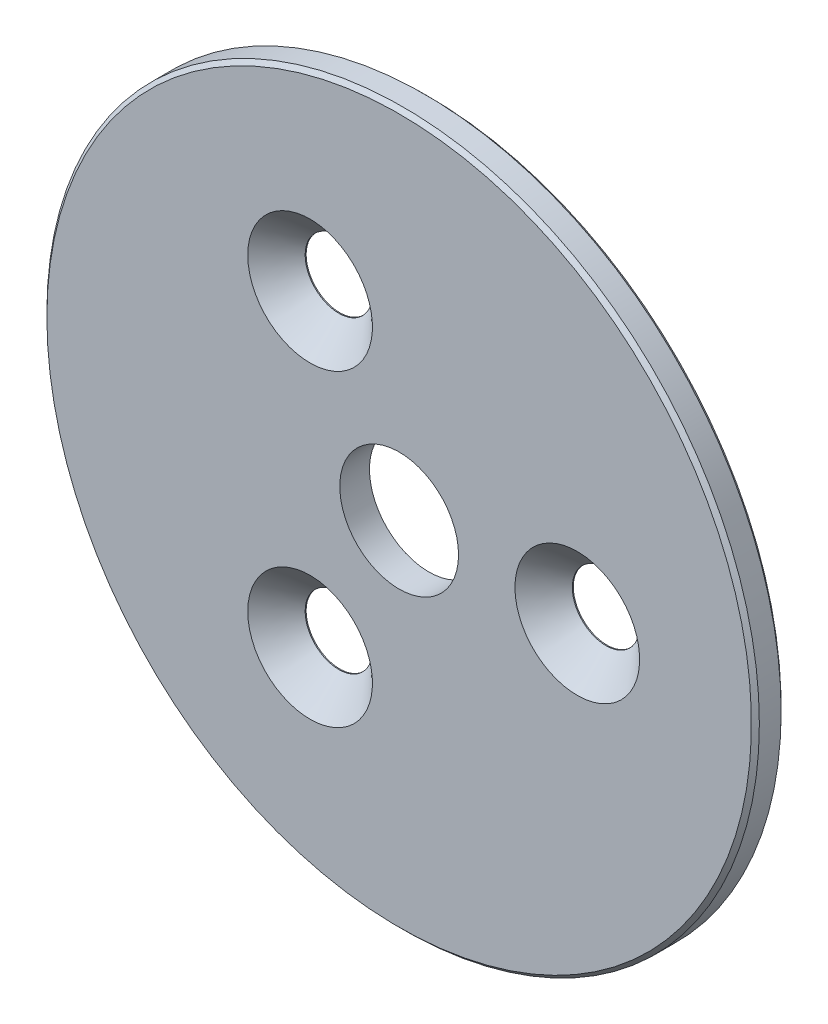
ISO-10303-21;
HEADER;
FILE_DESCRIPTION(('STEP AP214'),'2;1');
FILE_NAME('part.step','',(''),(''),'','','');
FILE_SCHEMA(('AUTOMOTIVE_DESIGN { 1 0 10303 214 1 1 1 1 }'));
ENDSEC;
DATA;
#1=APPLICATION_CONTEXT('core data for automotive mechanical design processes');
#2=APPLICATION_PROTOCOL_DEFINITION('international standard','automotive_design',2000,#1);
#3=PRODUCT_CONTEXT('',#1,'mechanical');
#4=PRODUCT('Part','Part','',(#3));
#5=PRODUCT_RELATED_PRODUCT_CATEGORY('part','',(#4));
#6=PRODUCT_DEFINITION_FORMATION('','',#4);
#7=PRODUCT_DEFINITION_CONTEXT('part definition',#1,'design');
#8=PRODUCT_DEFINITION('design','',#6,#7);
#9=PRODUCT_DEFINITION_SHAPE('','',#8);
#10=(LENGTH_UNIT() NAMED_UNIT(*) SI_UNIT(.MILLI.,.METRE.));
#11=(NAMED_UNIT(*) PLANE_ANGLE_UNIT() SI_UNIT($,.RADIAN.));
#12=(NAMED_UNIT(*) SI_UNIT($,.STERADIAN.) SOLID_ANGLE_UNIT());
#13=UNCERTAINTY_MEASURE_WITH_UNIT(LENGTH_MEASURE(1.E-05),#10,'distance_accuracy_value','');
#14=(GEOMETRIC_REPRESENTATION_CONTEXT(3) GLOBAL_UNCERTAINTY_ASSIGNED_CONTEXT((#13)) GLOBAL_UNIT_ASSIGNED_CONTEXT((#10,
#11,#12)) REPRESENTATION_CONTEXT('',''));
#15=CARTESIAN_POINT('',(0.,0.,0.));
#16=DIRECTION('',(0.,0.,1.));
#17=DIRECTION('',(1.,0.,0.));
#18=AXIS2_PLACEMENT_3D('',#15,#16,#17);
#19=CARTESIAN_POINT('',(0.,0.,1.5));
#20=DIRECTION('',(0.,0.,-1.));
#21=DIRECTION('',(-1.,0.,0.));
#22=AXIS2_PLACEMENT_3D('',#19,#20,#21);
#23=CYLINDRICAL_SURFACE('',#22,18.);
#24=CARTESIAN_POINT('',(0.,0.,0.2));
#25=DIRECTION('',(0.,0.,-1.));
#26=DIRECTION('',(-1.,0.,0.));
#27=AXIS2_PLACEMENT_3D('',#24,#25,#26);
#28=CIRCLE('',#27,18.);
#29=CARTESIAN_POINT('',(-18.,0.,0.2));
#30=VERTEX_POINT('',#29);
#31=EDGE_CURVE('E23',#30,#30,#28,.F.);
#32=ORIENTED_EDGE('',*,*,#31,.T.);
#33=EDGE_LOOP('',(#32));
#34=FACE_BOUND('',#33,.T.);
#35=CARTESIAN_POINT('',(0.,0.,1.3));
#36=DIRECTION('',(0.,0.,-1.));
#37=DIRECTION('',(-1.,0.,0.));
#38=AXIS2_PLACEMENT_3D('',#35,#36,#37);
#39=CIRCLE('',#38,18.);
#40=CARTESIAN_POINT('',(-18.,0.,1.3));
#41=VERTEX_POINT('',#40);
#42=EDGE_CURVE('E28',#41,#41,#39,.T.);
#43=ORIENTED_EDGE('',*,*,#42,.T.);
#44=EDGE_LOOP('',(#43));
#45=FACE_BOUND('',#44,.T.);
#46=ADVANCED_FACE('F15',(#34,#45),#23,.T.);
#47=CARTESIAN_POINT('',(0.,0.,1.5));
#48=DIRECTION('',(0.,0.,-1.));
#49=DIRECTION('',(-1.,0.,0.));
#50=AXIS2_PLACEMENT_3D('',#47,#48,#49);
#51=CYLINDRICAL_SURFACE('',#50,3.);
#52=CARTESIAN_POINT('',(0.,0.,1.5));
#53=DIRECTION('',(0.,0.,-1.));
#54=DIRECTION('',(1.,0.,0.));
#55=AXIS2_PLACEMENT_3D('',#52,#53,#54);
#56=CIRCLE('',#55,3.);
#57=CARTESIAN_POINT('',(3.,0.,1.5));
#58=VERTEX_POINT('',#57);
#59=EDGE_CURVE('E55',#58,#58,#56,.T.);
#60=ORIENTED_EDGE('',*,*,#59,.F.);
#61=EDGE_LOOP('',(#60));
#62=FACE_BOUND('',#61,.T.);
#63=CARTESIAN_POINT('',(0.,0.,0.));
#64=DIRECTION('',(0.,0.,-1.));
#65=DIRECTION('',(1.,0.,0.));
#66=AXIS2_PLACEMENT_3D('',#63,#64,#65);
#67=CIRCLE('',#66,3.);
#68=CARTESIAN_POINT('',(3.,0.,0.));
#69=VERTEX_POINT('',#68);
#70=EDGE_CURVE('E34',#69,#69,#67,.T.);
#71=ORIENTED_EDGE('',*,*,#70,.T.);
#72=EDGE_LOOP('',(#71));
#73=FACE_BOUND('',#72,.T.);
#74=ADVANCED_FACE('F81',(#62,#73),#51,.F.);
#75=CARTESIAN_POINT('',(0.,0.,1.5));
#76=DIRECTION('',(0.,0.,-1.));
#77=DIRECTION('',(-1.,0.,0.));
#78=AXIS2_PLACEMENT_3D('',#75,#76,#77);
#79=PLANE('',#78);
#80=CARTESIAN_POINT('',(-4.5,-7.79422863405994,1.5));
#81=DIRECTION('',(0.,0.,-1.));
#82=DIRECTION('',(-1.,0.,0.));
#83=AXIS2_PLACEMENT_3D('',#80,#81,#82);
#84=CIRCLE('',#83,3.15);
#85=CARTESIAN_POINT('',(-7.65,-7.79422863405994,1.5));
#86=VERTEX_POINT('',#85);
#87=EDGE_CURVE('E122',#86,#86,#84,.T.);
#88=ORIENTED_EDGE('',*,*,#87,.T.);
#89=EDGE_LOOP('',(#88));
#90=FACE_BOUND('',#89,.T.);
#91=CARTESIAN_POINT('',(-4.5,7.79422863405995,1.5));
#92=DIRECTION('',(0.,0.,-1.));
#93=DIRECTION('',(-1.,0.,0.));
#94=AXIS2_PLACEMENT_3D('',#91,#92,#93);
#95=CIRCLE('',#94,3.15);
#96=CARTESIAN_POINT('',(-7.65,7.79422863405995,1.5));
#97=VERTEX_POINT('',#96);
#98=EDGE_CURVE('E45',#97,#97,#95,.T.);
#99=ORIENTED_EDGE('',*,*,#98,.T.);
#100=EDGE_LOOP('',(#99));
#101=FACE_BOUND('',#100,.T.);
#102=CARTESIAN_POINT('',(9.,0.,1.5));
#103=DIRECTION('',(0.,0.,-1.));
#104=DIRECTION('',(-1.,0.,0.));
#105=AXIS2_PLACEMENT_3D('',#102,#103,#104);
#106=CIRCLE('',#105,3.15);
#107=CARTESIAN_POINT('',(5.85,0.,1.5));
#108=VERTEX_POINT('',#107);
#109=EDGE_CURVE('E38',#108,#108,#106,.T.);
#110=ORIENTED_EDGE('',*,*,#109,.T.);
#111=EDGE_LOOP('',(#110));
#112=FACE_BOUND('',#111,.T.);
#113=CARTESIAN_POINT('',(0.,0.,1.5));
#114=DIRECTION('',(0.,0.,-1.));
#115=DIRECTION('',(-1.,0.,0.));
#116=AXIS2_PLACEMENT_3D('',#113,#114,#115);
#117=CIRCLE('',#116,17.8);
#118=CARTESIAN_POINT('',(-17.8,0.,1.5));
#119=VERTEX_POINT('',#118);
#120=EDGE_CURVE('E10',#119,#119,#117,.F.);
#121=ORIENTED_EDGE('',*,*,#120,.T.);
#122=EDGE_LOOP('',(#121));
#123=FACE_BOUND('',#122,.T.);
#124=ORIENTED_EDGE('',*,*,#59,.T.);
#125=EDGE_LOOP('',(#124));
#126=FACE_BOUND('',#125,.T.);
#127=ADVANCED_FACE('F87',(#90,#101,#112,#123,#126),#79,.F.);
#128=CARTESIAN_POINT('',(0.,0.,0.));
#129=DIRECTION('',(0.,0.,-1.));
#130=DIRECTION('',(-1.,0.,0.));
#131=AXIS2_PLACEMENT_3D('',#128,#129,#130);
#132=PLANE('',#131);
#133=CARTESIAN_POINT('',(-4.5,-7.79422863405994,0.));
#134=DIRECTION('',(0.,0.,-1.));
#135=DIRECTION('',(-1.,0.,0.));
#136=AXIS2_PLACEMENT_3D('',#133,#134,#135);
#137=CIRCLE('',#136,1.7);
#138=CARTESIAN_POINT('',(-6.2,-7.79422863405994,0.));
#139=VERTEX_POINT('',#138);
#140=EDGE_CURVE('E19',#139,#139,#137,.T.);
#141=ORIENTED_EDGE('',*,*,#140,.F.);
#142=EDGE_LOOP('',(#141));
#143=FACE_BOUND('',#142,.T.);
#144=CARTESIAN_POINT('',(-4.5,7.79422863405995,0.));
#145=DIRECTION('',(0.,0.,-1.));
#146=DIRECTION('',(-1.,0.,0.));
#147=AXIS2_PLACEMENT_3D('',#144,#145,#146);
#148=CIRCLE('',#147,1.7);
#149=CARTESIAN_POINT('',(-6.2,7.79422863405995,0.));
#150=VERTEX_POINT('',#149);
#151=EDGE_CURVE('E36',#150,#150,#148,.T.);
#152=ORIENTED_EDGE('',*,*,#151,.F.);
#153=EDGE_LOOP('',(#152));
#154=FACE_BOUND('',#153,.T.);
#155=CARTESIAN_POINT('',(9.,0.,0.));
#156=DIRECTION('',(0.,0.,-1.));
#157=DIRECTION('',(-1.,0.,0.));
#158=AXIS2_PLACEMENT_3D('',#155,#156,#157);
#159=CIRCLE('',#158,1.7);
#160=CARTESIAN_POINT('',(7.3,0.,0.));
#161=VERTEX_POINT('',#160);
#162=EDGE_CURVE('E32',#161,#161,#159,.T.);
#163=ORIENTED_EDGE('',*,*,#162,.F.);
#164=EDGE_LOOP('',(#163));
#165=FACE_BOUND('',#164,.T.);
#166=CARTESIAN_POINT('',(0.,0.,0.));
#167=DIRECTION('',(0.,0.,-1.));
#168=DIRECTION('',(-1.,0.,0.));
#169=AXIS2_PLACEMENT_3D('',#166,#167,#168);
#170=CIRCLE('',#169,17.8);
#171=CARTESIAN_POINT('',(-17.8,0.,0.));
#172=VERTEX_POINT('',#171);
#173=EDGE_CURVE('E58',#172,#172,#170,.T.);
#174=ORIENTED_EDGE('',*,*,#173,.T.);
#175=EDGE_LOOP('',(#174));
#176=FACE_BOUND('',#175,.T.);
#177=ORIENTED_EDGE('',*,*,#70,.F.);
#178=EDGE_LOOP('',(#177));
#179=FACE_BOUND('',#178,.T.);
#180=ADVANCED_FACE('F78',(#143,#154,#165,#176,#179),#132,.T.);
#181=CARTESIAN_POINT('',(0.,0.,0.));
#182=DIRECTION('',(0.,0.,1.));
#183=DIRECTION('',(1.,0.,0.));
#184=AXIS2_PLACEMENT_3D('',#181,#182,#183);
#185=CONICAL_SURFACE('',#184,17.8,0.785398163397445);
#186=ORIENTED_EDGE('',*,*,#31,.F.);
#187=EDGE_LOOP('',(#186));
#188=FACE_BOUND('',#187,.T.);
#189=ORIENTED_EDGE('',*,*,#173,.F.);
#190=EDGE_LOOP('',(#189));
#191=FACE_BOUND('',#190,.T.);
#192=ADVANCED_FACE('F68',(#188,#191),#185,.T.);
#193=CARTESIAN_POINT('',(0.,0.,1.3));
#194=DIRECTION('',(0.,0.,-1.));
#195=DIRECTION('',(-1.,0.,0.));
#196=AXIS2_PLACEMENT_3D('',#193,#194,#195);
#197=CONICAL_SURFACE('',#196,18.,0.785398163397445);
#198=ORIENTED_EDGE('',*,*,#120,.F.);
#199=EDGE_LOOP('',(#198));
#200=FACE_BOUND('',#199,.T.);
#201=ORIENTED_EDGE('',*,*,#42,.F.);
#202=EDGE_LOOP('',(#201));
#203=FACE_BOUND('',#202,.T.);
#204=ADVANCED_FACE('F17',(#200,#203),#197,.T.);
#205=CARTESIAN_POINT('',(9.,0.,-5.85));
#206=DIRECTION('',(0.,0.,-1.));
#207=DIRECTION('',(-1.,0.,0.));
#208=AXIS2_PLACEMENT_3D('',#205,#206,#207);
#209=CYLINDRICAL_SURFACE('',#208,1.7);
#210=ORIENTED_EDGE('',*,*,#162,.T.);
#211=EDGE_LOOP('',(#210));
#212=FACE_BOUND('',#211,.T.);
#213=CARTESIAN_POINT('',(9.,0.,0.05));
#214=DIRECTION('',(0.,0.,-1.));
#215=DIRECTION('',(-1.,0.,0.));
#216=AXIS2_PLACEMENT_3D('',#213,#214,#215);
#217=CIRCLE('',#216,1.7);
#218=CARTESIAN_POINT('',(7.3,0.,0.05));
#219=VERTEX_POINT('',#218);
#220=EDGE_CURVE('E35',#219,#219,#217,.F.);
#221=ORIENTED_EDGE('',*,*,#220,.T.);
#222=EDGE_LOOP('',(#221));
#223=FACE_BOUND('',#222,.T.);
#224=ADVANCED_FACE('F67',(#212,#223),#209,.F.);
#225=CARTESIAN_POINT('',(9.,0.,1.5));
#226=DIRECTION('',(0.,0.,1.));
#227=DIRECTION('',(1.,0.,0.));
#228=AXIS2_PLACEMENT_3D('',#225,#226,#227);
#229=CONICAL_SURFACE('',#228,3.15,0.785398163397448);
#230=ORIENTED_EDGE('',*,*,#220,.F.);
#231=EDGE_LOOP('',(#230));
#232=FACE_BOUND('',#231,.T.);
#233=ORIENTED_EDGE('',*,*,#109,.F.);
#234=EDGE_LOOP('',(#233));
#235=FACE_BOUND('',#234,.T.);
#236=ADVANCED_FACE('F75',(#232,#235),#229,.F.);
#237=CARTESIAN_POINT('',(-4.5,7.79422863405995,-5.85));
#238=DIRECTION('',(0.,0.,-1.));
#239=DIRECTION('',(-1.,0.,0.));
#240=AXIS2_PLACEMENT_3D('',#237,#238,#239);
#241=CYLINDRICAL_SURFACE('',#240,1.7);
#242=ORIENTED_EDGE('',*,*,#151,.T.);
#243=EDGE_LOOP('',(#242));
#244=FACE_BOUND('',#243,.T.);
#245=CARTESIAN_POINT('',(-4.5,7.79422863405995,0.05));
#246=DIRECTION('',(0.,0.,-1.));
#247=DIRECTION('',(-1.,0.,0.));
#248=AXIS2_PLACEMENT_3D('',#245,#246,#247);
#249=CIRCLE('',#248,1.7);
#250=CARTESIAN_POINT('',(-6.2,7.79422863405995,0.05));
#251=VERTEX_POINT('',#250);
#252=EDGE_CURVE('E39',#251,#251,#249,.F.);
#253=ORIENTED_EDGE('',*,*,#252,.T.);
#254=EDGE_LOOP('',(#253));
#255=FACE_BOUND('',#254,.T.);
#256=ADVANCED_FACE('F98',(#244,#255),#241,.F.);
#257=CARTESIAN_POINT('',(-4.5,7.79422863405995,1.5));
#258=DIRECTION('',(0.,0.,1.));
#259=DIRECTION('',(1.,0.,0.));
#260=AXIS2_PLACEMENT_3D('',#257,#258,#259);
#261=CONICAL_SURFACE('',#260,3.15,0.785398163397448);
#262=ORIENTED_EDGE('',*,*,#252,.F.);
#263=EDGE_LOOP('',(#262));
#264=FACE_BOUND('',#263,.T.);
#265=ORIENTED_EDGE('',*,*,#98,.F.);
#266=EDGE_LOOP('',(#265));
#267=FACE_BOUND('',#266,.T.);
#268=ADVANCED_FACE('F101',(#264,#267),#261,.F.);
#269=CARTESIAN_POINT('',(-4.5,-7.79422863405994,-5.85));
#270=DIRECTION('',(0.,0.,-1.));
#271=DIRECTION('',(-1.,0.,0.));
#272=AXIS2_PLACEMENT_3D('',#269,#270,#271);
#273=CYLINDRICAL_SURFACE('',#272,1.7);
#274=ORIENTED_EDGE('',*,*,#140,.T.);
#275=EDGE_LOOP('',(#274));
#276=FACE_BOUND('',#275,.T.);
#277=CARTESIAN_POINT('',(-4.5,-7.79422863405994,0.05));
#278=DIRECTION('',(0.,0.,-1.));
#279=DIRECTION('',(-1.,0.,0.));
#280=AXIS2_PLACEMENT_3D('',#277,#278,#279);
#281=CIRCLE('',#280,1.7);
#282=CARTESIAN_POINT('',(-6.2,-7.79422863405994,0.05));
#283=VERTEX_POINT('',#282);
#284=EDGE_CURVE('E121',#283,#283,#281,.F.);
#285=ORIENTED_EDGE('',*,*,#284,.T.);
#286=EDGE_LOOP('',(#285));
#287=FACE_BOUND('',#286,.T.);
#288=ADVANCED_FACE('F104',(#276,#287),#273,.F.);
#289=CARTESIAN_POINT('',(-4.5,-7.79422863405994,1.5));
#290=DIRECTION('',(0.,0.,1.));
#291=DIRECTION('',(1.,0.,0.));
#292=AXIS2_PLACEMENT_3D('',#289,#290,#291);
#293=CONICAL_SURFACE('',#292,3.15,0.785398163397448);
#294=ORIENTED_EDGE('',*,*,#284,.F.);
#295=EDGE_LOOP('',(#294));
#296=FACE_BOUND('',#295,.T.);
#297=ORIENTED_EDGE('',*,*,#87,.F.);
#298=EDGE_LOOP('',(#297));
#299=FACE_BOUND('',#298,.T.);
#300=ADVANCED_FACE('F108',(#296,#299),#293,.F.);
#301=CLOSED_SHELL('',(#46,#74,#127,#180,#192,#204,#224,#236,#256,#268,#288,#300));
#302=MANIFOLD_SOLID_BREP('B1',#301);
#303=ADVANCED_BREP_SHAPE_REPRESENTATION('',(#18,#302),#14);
#304=SHAPE_DEFINITION_REPRESENTATION(#9,#303);
ENDSEC;
END-ISO-10303-21;
